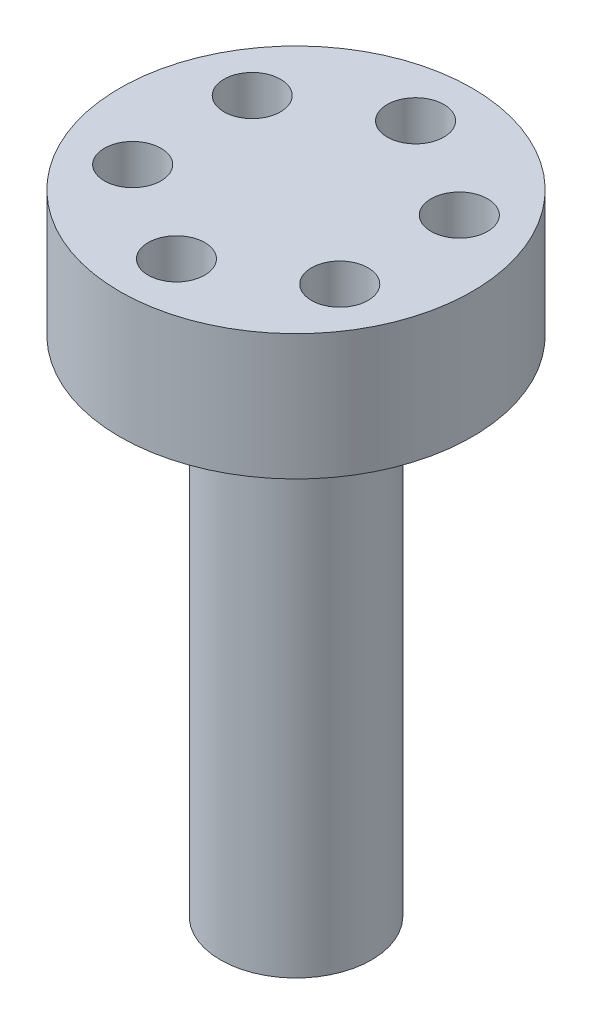
ISO-10303-21;
HEADER;
FILE_DESCRIPTION(('STEP AP214'),'2;1');
FILE_NAME('part.step','',(''),(''),'','','');
FILE_SCHEMA(('AUTOMOTIVE_DESIGN { 1 0 10303 214 1 1 1 1 }'));
ENDSEC;
DATA;
#1=APPLICATION_CONTEXT('core data for automotive mechanical design processes');
#2=APPLICATION_PROTOCOL_DEFINITION('international standard','automotive_design',2000,#1);
#3=PRODUCT_CONTEXT('',#1,'mechanical');
#4=PRODUCT('Part','Part','',(#3));
#5=PRODUCT_RELATED_PRODUCT_CATEGORY('part','',(#4));
#6=PRODUCT_DEFINITION_FORMATION('','',#4);
#7=PRODUCT_DEFINITION_CONTEXT('part definition',#1,'design');
#8=PRODUCT_DEFINITION('design','',#6,#7);
#9=PRODUCT_DEFINITION_SHAPE('','',#8);
#10=(LENGTH_UNIT() NAMED_UNIT(*) SI_UNIT(.MILLI.,.METRE.));
#11=(NAMED_UNIT(*) PLANE_ANGLE_UNIT() SI_UNIT($,.RADIAN.));
#12=(NAMED_UNIT(*) SI_UNIT($,.STERADIAN.) SOLID_ANGLE_UNIT());
#13=UNCERTAINTY_MEASURE_WITH_UNIT(LENGTH_MEASURE(1.E-05),#10,'distance_accuracy_value','');
#14=(GEOMETRIC_REPRESENTATION_CONTEXT(3) GLOBAL_UNCERTAINTY_ASSIGNED_CONTEXT((#13)) GLOBAL_UNIT_ASSIGNED_CONTEXT((#10,
#11,#12)) REPRESENTATION_CONTEXT('',''));
#15=CARTESIAN_POINT('',(0.,0.,0.));
#16=DIRECTION('',(0.,0.,1.));
#17=DIRECTION('',(1.,0.,0.));
#18=AXIS2_PLACEMENT_3D('',#15,#16,#17);
#19=CARTESIAN_POINT('',(0.,20.,0.));
#20=DIRECTION('',(0.,-1.,0.));
#21=DIRECTION('',(0.,0.,-1.));
#22=AXIS2_PLACEMENT_3D('',#19,#20,#21);
#23=CYLINDRICAL_SURFACE('',#22,6.);
#24=CARTESIAN_POINT('',(0.,20.,0.));
#25=DIRECTION('',(0.,1.,0.));
#26=DIRECTION('',(0.,0.,1.));
#27=AXIS2_PLACEMENT_3D('',#24,#25,#26);
#28=CIRCLE('',#27,6.);
#29=CARTESIAN_POINT('',(0.,20.,6.));
#30=VERTEX_POINT('',#29);
#31=EDGE_CURVE('E10',#30,#30,#28,.T.);
#32=ORIENTED_EDGE('',*,*,#31,.F.);
#33=EDGE_LOOP('',(#32));
#34=FACE_BOUND('',#33,.T.);
#35=CARTESIAN_POINT('',(0.,-20.,0.));
#36=DIRECTION('',(0.,1.,0.));
#37=DIRECTION('',(0.,0.,1.));
#38=AXIS2_PLACEMENT_3D('',#35,#36,#37);
#39=CIRCLE('',#38,6.);
#40=CARTESIAN_POINT('',(0.,-20.,6.));
#41=VERTEX_POINT('',#40);
#42=EDGE_CURVE('E33',#41,#41,#39,.T.);
#43=ORIENTED_EDGE('',*,*,#42,.T.);
#44=EDGE_LOOP('',(#43));
#45=FACE_BOUND('',#44,.T.);
#46=ADVANCED_FACE('F30',(#34,#45),#23,.T.);
#47=CARTESIAN_POINT('',(0.,-20.,0.));
#48=DIRECTION('',(0.,1.,0.));
#49=DIRECTION('',(0.,0.,1.));
#50=AXIS2_PLACEMENT_3D('',#47,#48,#49);
#51=PLANE('',#50);
#52=CARTESIAN_POINT('',(2.59807621135331,-20.,-1.50000000000001));
#53=DIRECTION('',(0.,-1.,0.));
#54=DIRECTION('',(-0.866025403784436,0.,0.500000000000004));
#55=AXIS2_PLACEMENT_3D('',#52,#53,#54);
#56=CIRCLE('',#55,1.75);
#57=CARTESIAN_POINT('',(1.08253175473055,-20.,-0.625000000000005));
#58=VERTEX_POINT('',#57);
#59=EDGE_CURVE('E96',#58,#58,#56,.T.);
#60=ORIENTED_EDGE('',*,*,#59,.F.);
#61=EDGE_LOOP('',(#60));
#62=FACE_BOUND('',#61,.T.);
#63=CARTESIAN_POINT('',(-2.59807621135333,-20.,-1.49999999999998));
#64=DIRECTION('',(0.,-1.,0.));
#65=DIRECTION('',(0.866025403784443,0.,0.499999999999992));
#66=AXIS2_PLACEMENT_3D('',#63,#64,#65);
#67=CIRCLE('',#66,1.75);
#68=CARTESIAN_POINT('',(-1.08253175473055,-20.,-0.62499999999999));
#69=VERTEX_POINT('',#68);
#70=EDGE_CURVE('E90',#69,#69,#67,.T.);
#71=ORIENTED_EDGE('',*,*,#70,.F.);
#72=EDGE_LOOP('',(#71));
#73=FACE_BOUND('',#72,.T.);
#74=CARTESIAN_POINT('',(0.,-20.,3.));
#75=DIRECTION('',(0.,-1.,0.));
#76=DIRECTION('',(0.,0.,-1.));
#77=AXIS2_PLACEMENT_3D('',#74,#75,#76);
#78=CIRCLE('',#77,1.75);
#79=CARTESIAN_POINT('',(0.,-20.,1.25));
#80=VERTEX_POINT('',#79);
#81=EDGE_CURVE('E84',#80,#80,#78,.T.);
#82=ORIENTED_EDGE('',*,*,#81,.F.);
#83=EDGE_LOOP('',(#82));
#84=FACE_BOUND('',#83,.T.);
#85=ORIENTED_EDGE('',*,*,#42,.F.);
#86=EDGE_LOOP('',(#85));
#87=FACE_BOUND('',#86,.T.);
#88=ADVANCED_FACE('F111',(#62,#73,#84,#87),#51,.F.);
#89=CARTESIAN_POINT('',(0.,30.,0.));
#90=DIRECTION('',(0.,-1.,0.));
#91=DIRECTION('',(0.,0.,-1.));
#92=AXIS2_PLACEMENT_3D('',#89,#90,#91);
#93=CYLINDRICAL_SURFACE('',#92,14.);
#94=CARTESIAN_POINT('',(0.,30.,0.));
#95=DIRECTION('',(0.,1.,0.));
#96=DIRECTION('',(0.,0.,1.));
#97=AXIS2_PLACEMENT_3D('',#94,#95,#96);
#98=CIRCLE('',#97,14.);
#99=CARTESIAN_POINT('',(0.,30.,14.));
#100=VERTEX_POINT('',#99);
#101=EDGE_CURVE('E40',#100,#100,#98,.T.);
#102=ORIENTED_EDGE('',*,*,#101,.F.);
#103=EDGE_LOOP('',(#102));
#104=FACE_BOUND('',#103,.T.);
#105=CARTESIAN_POINT('',(0.,20.,0.));
#106=DIRECTION('',(0.,1.,0.));
#107=DIRECTION('',(0.,0.,1.));
#108=AXIS2_PLACEMENT_3D('',#105,#106,#107);
#109=CIRCLE('',#108,14.);
#110=CARTESIAN_POINT('',(0.,20.,14.));
#111=VERTEX_POINT('',#110);
#112=EDGE_CURVE('E42',#111,#111,#109,.T.);
#113=ORIENTED_EDGE('',*,*,#112,.T.);
#114=EDGE_LOOP('',(#113));
#115=FACE_BOUND('',#114,.T.);
#116=ADVANCED_FACE('F114',(#104,#115),#93,.T.);
#117=CARTESIAN_POINT('',(0.,30.,0.));
#118=DIRECTION('',(0.,1.,0.));
#119=DIRECTION('',(0.,0.,1.));
#120=AXIS2_PLACEMENT_3D('',#117,#118,#119);
#121=PLANE('',#120);
#122=CARTESIAN_POINT('',(8.22724133595211,30.,-4.7500000000001));
#123=DIRECTION('',(0.,1.,0.));
#124=DIRECTION('',(-0.866025403784433,0.,0.50000000000001));
#125=AXIS2_PLACEMENT_3D('',#122,#123,#124);
#126=CIRCLE('',#125,2.25);
#127=CARTESIAN_POINT('',(6.27868417743714,30.,-3.62500000000007));
#128=VERTEX_POINT('',#127);
#129=EDGE_CURVE('E60',#128,#128,#126,.T.);
#130=ORIENTED_EDGE('',*,*,#129,.F.);
#131=EDGE_LOOP('',(#130));
#132=FACE_BOUND('',#131,.T.);
#133=CARTESIAN_POINT('',(8.22724133595221,30.,4.74999999999992));
#134=DIRECTION('',(0.,1.,0.));
#135=DIRECTION('',(-0.866025403784443,0.,-0.499999999999992));
#136=AXIS2_PLACEMENT_3D('',#133,#134,#135);
#137=CIRCLE('',#136,2.25);
#138=CARTESIAN_POINT('',(6.27868417743721,30.,3.62499999999994));
#139=VERTEX_POINT('',#138);
#140=EDGE_CURVE('E67',#139,#139,#137,.T.);
#141=ORIENTED_EDGE('',*,*,#140,.F.);
#142=EDGE_LOOP('',(#141));
#143=FACE_BOUND('',#142,.T.);
#144=CARTESIAN_POINT('',(0.,30.,9.5));
#145=DIRECTION('',(0.,1.,0.));
#146=DIRECTION('',(0.,0.,-1.));
#147=AXIS2_PLACEMENT_3D('',#144,#145,#146);
#148=CIRCLE('',#147,2.25);
#149=CARTESIAN_POINT('',(0.,30.,7.25));
#150=VERTEX_POINT('',#149);
#151=EDGE_CURVE('E73',#150,#150,#148,.T.);
#152=ORIENTED_EDGE('',*,*,#151,.F.);
#153=EDGE_LOOP('',(#152));
#154=FACE_BOUND('',#153,.T.);
#155=CARTESIAN_POINT('',(-8.22724133595215,30.,4.75000000000004));
#156=DIRECTION('',(0.,1.,0.));
#157=DIRECTION('',(0.866025403784436,0.,-0.500000000000004));
#158=AXIS2_PLACEMENT_3D('',#155,#156,#157);
#159=CIRCLE('',#158,2.25);
#160=CARTESIAN_POINT('',(-6.27868417743716,30.,3.62500000000003));
#161=VERTEX_POINT('',#160);
#162=EDGE_CURVE('E79',#161,#161,#159,.T.);
#163=ORIENTED_EDGE('',*,*,#162,.F.);
#164=EDGE_LOOP('',(#163));
#165=FACE_BOUND('',#164,.T.);
#166=CARTESIAN_POINT('',(-8.22724133595218,30.,-4.74999999999998));
#167=DIRECTION('',(0.,1.,0.));
#168=DIRECTION('',(0.86602540378444,0.,0.499999999999998));
#169=AXIS2_PLACEMENT_3D('',#166,#167,#168);
#170=CIRCLE('',#169,2.25);
#171=CARTESIAN_POINT('',(-6.27868417743719,30.,-3.62499999999999));
#172=VERTEX_POINT('',#171);
#173=EDGE_CURVE('E54',#172,#172,#170,.T.);
#174=ORIENTED_EDGE('',*,*,#173,.F.);
#175=EDGE_LOOP('',(#174));
#176=FACE_BOUND('',#175,.T.);
#177=CARTESIAN_POINT('',(0.,30.,-9.5));
#178=DIRECTION('',(0.,1.,0.));
#179=DIRECTION('',(0.,0.,1.));
#180=AXIS2_PLACEMENT_3D('',#177,#178,#179);
#181=CIRCLE('',#180,2.25);
#182=CARTESIAN_POINT('',(0.,30.,-7.25));
#183=VERTEX_POINT('',#182);
#184=EDGE_CURVE('E48',#183,#183,#181,.T.);
#185=ORIENTED_EDGE('',*,*,#184,.F.);
#186=EDGE_LOOP('',(#185));
#187=FACE_BOUND('',#186,.T.);
#188=ORIENTED_EDGE('',*,*,#101,.T.);
#189=EDGE_LOOP('',(#188));
#190=FACE_BOUND('',#189,.T.);
#191=ADVANCED_FACE('F137',(#132,#143,#154,#165,#176,#187,#190),#121,.T.);
#192=CARTESIAN_POINT('',(0.,20.,0.));
#193=DIRECTION('',(0.,1.,0.));
#194=DIRECTION('',(0.,0.,1.));
#195=AXIS2_PLACEMENT_3D('',#192,#193,#194);
#196=PLANE('',#195);
#197=CARTESIAN_POINT('',(8.22724133595211,20.,-4.7500000000001));
#198=DIRECTION('',(0.,1.,0.));
#199=DIRECTION('',(-0.866025403784433,0.,0.50000000000001));
#200=AXIS2_PLACEMENT_3D('',#197,#198,#199);
#201=CIRCLE('',#200,2.25);
#202=CARTESIAN_POINT('',(6.27868417743714,20.,-3.62500000000007));
#203=VERTEX_POINT('',#202);
#204=EDGE_CURVE('E63',#203,#203,#201,.T.);
#205=ORIENTED_EDGE('',*,*,#204,.T.);
#206=EDGE_LOOP('',(#205));
#207=FACE_BOUND('',#206,.T.);
#208=CARTESIAN_POINT('',(8.22724133595221,20.,4.74999999999992));
#209=DIRECTION('',(0.,1.,0.));
#210=DIRECTION('',(-0.866025403784443,0.,-0.499999999999992));
#211=AXIS2_PLACEMENT_3D('',#208,#209,#210);
#212=CIRCLE('',#211,2.25);
#213=CARTESIAN_POINT('',(6.27868417743721,20.,3.62499999999994));
#214=VERTEX_POINT('',#213);
#215=EDGE_CURVE('E70',#214,#214,#212,.T.);
#216=ORIENTED_EDGE('',*,*,#215,.T.);
#217=EDGE_LOOP('',(#216));
#218=FACE_BOUND('',#217,.T.);
#219=CARTESIAN_POINT('',(0.,20.,9.5));
#220=DIRECTION('',(0.,1.,0.));
#221=DIRECTION('',(0.,0.,-1.));
#222=AXIS2_PLACEMENT_3D('',#219,#220,#221);
#223=CIRCLE('',#222,2.25);
#224=CARTESIAN_POINT('',(0.,20.,7.25));
#225=VERTEX_POINT('',#224);
#226=EDGE_CURVE('E76',#225,#225,#223,.T.);
#227=ORIENTED_EDGE('',*,*,#226,.T.);
#228=EDGE_LOOP('',(#227));
#229=FACE_BOUND('',#228,.T.);
#230=CARTESIAN_POINT('',(-8.22724133595215,20.,4.75000000000004));
#231=DIRECTION('',(0.,1.,0.));
#232=DIRECTION('',(0.866025403784436,0.,-0.500000000000004));
#233=AXIS2_PLACEMENT_3D('',#230,#231,#232);
#234=CIRCLE('',#233,2.25);
#235=CARTESIAN_POINT('',(-6.27868417743716,20.,3.62500000000003));
#236=VERTEX_POINT('',#235);
#237=EDGE_CURVE('E57',#236,#236,#234,.T.);
#238=ORIENTED_EDGE('',*,*,#237,.T.);
#239=EDGE_LOOP('',(#238));
#240=FACE_BOUND('',#239,.T.);
#241=CARTESIAN_POINT('',(-8.22724133595218,20.,-4.74999999999998));
#242=DIRECTION('',(0.,1.,0.));
#243=DIRECTION('',(0.86602540378444,0.,0.499999999999998));
#244=AXIS2_PLACEMENT_3D('',#241,#242,#243);
#245=CIRCLE('',#244,2.25);
#246=CARTESIAN_POINT('',(-6.27868417743719,20.,-3.62499999999999));
#247=VERTEX_POINT('',#246);
#248=EDGE_CURVE('E51',#247,#247,#245,.T.);
#249=ORIENTED_EDGE('',*,*,#248,.T.);
#250=EDGE_LOOP('',(#249));
#251=FACE_BOUND('',#250,.T.);
#252=CARTESIAN_POINT('',(0.,20.,-9.5));
#253=DIRECTION('',(0.,1.,0.));
#254=DIRECTION('',(0.,0.,1.));
#255=AXIS2_PLACEMENT_3D('',#252,#253,#254);
#256=CIRCLE('',#255,2.25);
#257=CARTESIAN_POINT('',(0.,20.,-7.25));
#258=VERTEX_POINT('',#257);
#259=EDGE_CURVE('E45',#258,#258,#256,.T.);
#260=ORIENTED_EDGE('',*,*,#259,.T.);
#261=EDGE_LOOP('',(#260));
#262=FACE_BOUND('',#261,.T.);
#263=ORIENTED_EDGE('',*,*,#31,.T.);
#264=EDGE_LOOP('',(#263));
#265=FACE_BOUND('',#264,.T.);
#266=ORIENTED_EDGE('',*,*,#112,.F.);
#267=EDGE_LOOP('',(#266));
#268=FACE_BOUND('',#267,.T.);
#269=ADVANCED_FACE('F146',(#207,#218,#229,#240,#251,#262,#265,#268),#196,.F.);
#270=CARTESIAN_POINT('',(0.,20.,-9.5));
#271=DIRECTION('',(0.,1.,0.));
#272=DIRECTION('',(0.,0.,1.));
#273=AXIS2_PLACEMENT_3D('',#270,#271,#272);
#274=CYLINDRICAL_SURFACE('',#273,2.25);
#275=ORIENTED_EDGE('',*,*,#259,.F.);
#276=EDGE_LOOP('',(#275));
#277=FACE_BOUND('',#276,.T.);
#278=ORIENTED_EDGE('',*,*,#184,.T.);
#279=EDGE_LOOP('',(#278));
#280=FACE_BOUND('',#279,.T.);
#281=ADVANCED_FACE('F154',(#277,#280),#274,.F.);
#282=CARTESIAN_POINT('',(-8.22724133595218,20.,-4.74999999999998));
#283=DIRECTION('',(0.,1.,0.));
#284=DIRECTION('',(0.,0.,1.));
#285=AXIS2_PLACEMENT_3D('',#282,#283,#284);
#286=CYLINDRICAL_SURFACE('',#285,2.25);
#287=ORIENTED_EDGE('',*,*,#248,.F.);
#288=EDGE_LOOP('',(#287));
#289=FACE_BOUND('',#288,.T.);
#290=ORIENTED_EDGE('',*,*,#173,.T.);
#291=EDGE_LOOP('',(#290));
#292=FACE_BOUND('',#291,.T.);
#293=ADVANCED_FACE('F162',(#289,#292),#286,.F.);
#294=CARTESIAN_POINT('',(-8.22724133595215,20.,4.75000000000004));
#295=DIRECTION('',(0.,1.,0.));
#296=DIRECTION('',(0.,0.,1.));
#297=AXIS2_PLACEMENT_3D('',#294,#295,#296);
#298=CYLINDRICAL_SURFACE('',#297,2.25);
#299=ORIENTED_EDGE('',*,*,#237,.F.);
#300=EDGE_LOOP('',(#299));
#301=FACE_BOUND('',#300,.T.);
#302=ORIENTED_EDGE('',*,*,#162,.T.);
#303=EDGE_LOOP('',(#302));
#304=FACE_BOUND('',#303,.T.);
#305=ADVANCED_FACE('F169',(#301,#304),#298,.F.);
#306=CARTESIAN_POINT('',(0.,20.,9.5));
#307=DIRECTION('',(0.,1.,0.));
#308=DIRECTION('',(0.,0.,1.));
#309=AXIS2_PLACEMENT_3D('',#306,#307,#308);
#310=CYLINDRICAL_SURFACE('',#309,2.25);
#311=ORIENTED_EDGE('',*,*,#226,.F.);
#312=EDGE_LOOP('',(#311));
#313=FACE_BOUND('',#312,.T.);
#314=ORIENTED_EDGE('',*,*,#151,.T.);
#315=EDGE_LOOP('',(#314));
#316=FACE_BOUND('',#315,.T.);
#317=ADVANCED_FACE('F177',(#313,#316),#310,.F.);
#318=CARTESIAN_POINT('',(8.22724133595221,20.,4.74999999999992));
#319=DIRECTION('',(0.,1.,0.));
#320=DIRECTION('',(0.,0.,1.));
#321=AXIS2_PLACEMENT_3D('',#318,#319,#320);
#322=CYLINDRICAL_SURFACE('',#321,2.25);
#323=ORIENTED_EDGE('',*,*,#215,.F.);
#324=EDGE_LOOP('',(#323));
#325=FACE_BOUND('',#324,.T.);
#326=ORIENTED_EDGE('',*,*,#140,.T.);
#327=EDGE_LOOP('',(#326));
#328=FACE_BOUND('',#327,.T.);
#329=ADVANCED_FACE('F185',(#325,#328),#322,.F.);
#330=CARTESIAN_POINT('',(8.22724133595211,20.,-4.7500000000001));
#331=DIRECTION('',(0.,1.,0.));
#332=DIRECTION('',(0.,0.,1.));
#333=AXIS2_PLACEMENT_3D('',#330,#331,#332);
#334=CYLINDRICAL_SURFACE('',#333,2.25);
#335=ORIENTED_EDGE('',*,*,#204,.F.);
#336=EDGE_LOOP('',(#335));
#337=FACE_BOUND('',#336,.T.);
#338=ORIENTED_EDGE('',*,*,#129,.T.);
#339=EDGE_LOOP('',(#338));
#340=FACE_BOUND('',#339,.T.);
#341=ADVANCED_FACE('F193',(#337,#340),#334,.F.);
#342=CARTESIAN_POINT('',(0.,-10.,3.));
#343=DIRECTION('',(0.,-1.,0.));
#344=DIRECTION('',(0.,0.,-1.));
#345=AXIS2_PLACEMENT_3D('',#342,#343,#344);
#346=CYLINDRICAL_SURFACE('',#345,1.75);
#347=CARTESIAN_POINT('',(0.,-10.,3.));
#348=DIRECTION('',(0.,-1.,0.));
#349=DIRECTION('',(0.,0.,-1.));
#350=AXIS2_PLACEMENT_3D('',#347,#348,#349);
#351=CIRCLE('',#350,1.75);
#352=CARTESIAN_POINT('',(0.,-10.,1.25));
#353=VERTEX_POINT('',#352);
#354=EDGE_CURVE('E64',#353,#353,#351,.T.);
#355=ORIENTED_EDGE('',*,*,#354,.F.);
#356=EDGE_LOOP('',(#355));
#357=FACE_BOUND('',#356,.T.);
#358=ORIENTED_EDGE('',*,*,#81,.T.);
#359=EDGE_LOOP('',(#358));
#360=FACE_BOUND('',#359,.T.);
#361=ADVANCED_FACE('F201',(#357,#360),#346,.F.);
#362=CARTESIAN_POINT('',(0.,-10.,3.));
#363=DIRECTION('',(0.,-1.,0.));
#364=DIRECTION('',(0.,0.,-1.));
#365=AXIS2_PLACEMENT_3D('',#362,#363,#364);
#366=PLANE('',#365);
#367=ORIENTED_EDGE('',*,*,#354,.T.);
#368=EDGE_LOOP('',(#367));
#369=FACE_BOUND('',#368,.T.);
#370=ADVANCED_FACE('F209',(#369),#366,.T.);
#371=CARTESIAN_POINT('',(-2.59807621135333,-10.,-1.49999999999998));
#372=DIRECTION('',(0.,-1.,0.));
#373=DIRECTION('',(0.,0.,-1.));
#374=AXIS2_PLACEMENT_3D('',#371,#372,#373);
#375=CYLINDRICAL_SURFACE('',#374,1.75);
#376=CARTESIAN_POINT('',(-2.59807621135333,-10.,-1.49999999999998));
#377=DIRECTION('',(0.,-1.,0.));
#378=DIRECTION('',(0.866025403784443,0.,0.499999999999992));
#379=AXIS2_PLACEMENT_3D('',#376,#377,#378);
#380=CIRCLE('',#379,1.75);
#381=CARTESIAN_POINT('',(-1.08253175473055,-10.,-0.62499999999999));
#382=VERTEX_POINT('',#381);
#383=EDGE_CURVE('E93',#382,#382,#380,.T.);
#384=ORIENTED_EDGE('',*,*,#383,.F.);
#385=EDGE_LOOP('',(#384));
#386=FACE_BOUND('',#385,.T.);
#387=ORIENTED_EDGE('',*,*,#70,.T.);
#388=EDGE_LOOP('',(#387));
#389=FACE_BOUND('',#388,.T.);
#390=ADVANCED_FACE('F216',(#386,#389),#375,.F.);
#391=CARTESIAN_POINT('',(-2.59807621135333,-10.,-1.49999999999998));
#392=DIRECTION('',(0.,-1.,0.));
#393=DIRECTION('',(0.866025403784443,0.,0.499999999999992));
#394=AXIS2_PLACEMENT_3D('',#391,#392,#393);
#395=PLANE('',#394);
#396=ORIENTED_EDGE('',*,*,#383,.T.);
#397=EDGE_LOOP('',(#396));
#398=FACE_BOUND('',#397,.T.);
#399=ADVANCED_FACE('F107',(#398),#395,.T.);
#400=CARTESIAN_POINT('',(2.59807621135331,-10.,-1.50000000000001));
#401=DIRECTION('',(0.,-1.,0.));
#402=DIRECTION('',(0.,0.,-1.));
#403=AXIS2_PLACEMENT_3D('',#400,#401,#402);
#404=CYLINDRICAL_SURFACE('',#403,1.75);
#405=CARTESIAN_POINT('',(2.59807621135331,-10.,-1.50000000000001));
#406=DIRECTION('',(0.,-1.,0.));
#407=DIRECTION('',(-0.866025403784436,0.,0.500000000000004));
#408=AXIS2_PLACEMENT_3D('',#405,#406,#407);
#409=CIRCLE('',#408,1.75);
#410=CARTESIAN_POINT('',(1.08253175473055,-10.,-0.625000000000005));
#411=VERTEX_POINT('',#410);
#412=EDGE_CURVE('E87',#411,#411,#409,.T.);
#413=ORIENTED_EDGE('',*,*,#412,.F.);
#414=EDGE_LOOP('',(#413));
#415=FACE_BOUND('',#414,.T.);
#416=ORIENTED_EDGE('',*,*,#59,.T.);
#417=EDGE_LOOP('',(#416));
#418=FACE_BOUND('',#417,.T.);
#419=ADVANCED_FACE('F104',(#415,#418),#404,.F.);
#420=CARTESIAN_POINT('',(2.59807621135331,-10.,-1.50000000000001));
#421=DIRECTION('',(0.,-1.,0.));
#422=DIRECTION('',(-0.866025403784436,0.,0.500000000000004));
#423=AXIS2_PLACEMENT_3D('',#420,#421,#422);
#424=PLANE('',#423);
#425=ORIENTED_EDGE('',*,*,#412,.T.);
#426=EDGE_LOOP('',(#425));
#427=FACE_BOUND('',#426,.T.);
#428=ADVANCED_FACE('F102',(#427),#424,.T.);
#429=CLOSED_SHELL('',(#46,#88,#116,#191,#269,#281,#293,#305,#317,#329,#341,#361,#370,#390,#399,
#419,#428));
#430=MANIFOLD_SOLID_BREP('B2',#429);
#431=ADVANCED_BREP_SHAPE_REPRESENTATION('',(#18,#430),#14);
#432=SHAPE_DEFINITION_REPRESENTATION(#9,#431);
ENDSEC;
END-ISO-10303-21;
